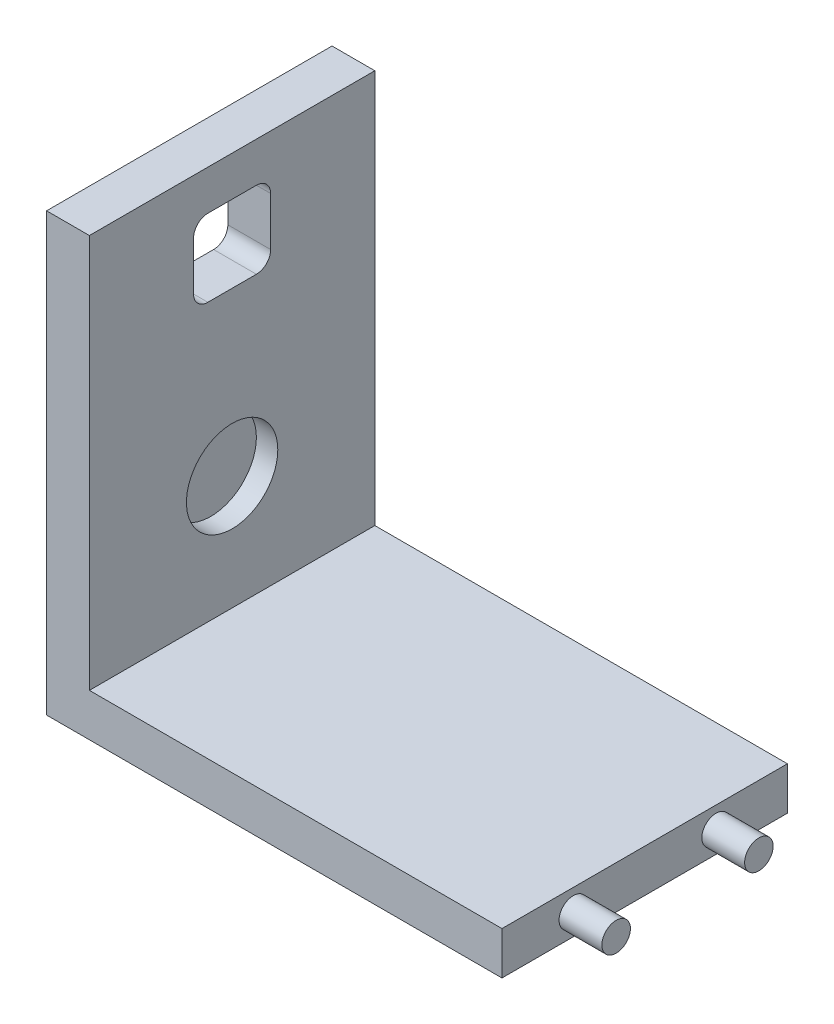
ISO-10303-21;
HEADER;
FILE_DESCRIPTION(('STEP AP214'),'2;1');
FILE_NAME('part.step','',(''),(''),'','','');
FILE_SCHEMA(('AUTOMOTIVE_DESIGN { 1 0 10303 214 1 1 1 1 }'));
ENDSEC;
DATA;
#1=APPLICATION_CONTEXT('core data for automotive mechanical design processes');
#2=APPLICATION_PROTOCOL_DEFINITION('international standard','automotive_design',2000,#1);
#3=PRODUCT_CONTEXT('',#1,'mechanical');
#4=PRODUCT('Part','Part','',(#3));
#5=PRODUCT_RELATED_PRODUCT_CATEGORY('part','',(#4));
#6=PRODUCT_DEFINITION_FORMATION('','',#4);
#7=PRODUCT_DEFINITION_CONTEXT('part definition',#1,'design');
#8=PRODUCT_DEFINITION('design','',#6,#7);
#9=PRODUCT_DEFINITION_SHAPE('','',#8);
#10=(LENGTH_UNIT() NAMED_UNIT(*) SI_UNIT(.MILLI.,.METRE.));
#11=(NAMED_UNIT(*) PLANE_ANGLE_UNIT() SI_UNIT($,.RADIAN.));
#12=(NAMED_UNIT(*) SI_UNIT($,.STERADIAN.) SOLID_ANGLE_UNIT());
#13=UNCERTAINTY_MEASURE_WITH_UNIT(LENGTH_MEASURE(1.E-05),#10,'distance_accuracy_value','');
#14=(GEOMETRIC_REPRESENTATION_CONTEXT(3) GLOBAL_UNCERTAINTY_ASSIGNED_CONTEXT((#13)) GLOBAL_UNIT_ASSIGNED_CONTEXT((#10,
#11,#12)) REPRESENTATION_CONTEXT('',''));
#15=CARTESIAN_POINT('',(0.,0.,0.));
#16=DIRECTION('',(0.,0.,1.));
#17=DIRECTION('',(1.,0.,0.));
#18=AXIS2_PLACEMENT_3D('',#15,#16,#17);
#19=CARTESIAN_POINT('',(-87.2699081698724,0.,-100.));
#20=DIRECTION('',(-1.,0.,0.));
#21=DIRECTION('',(0.,0.,1.));
#22=AXIS2_PLACEMENT_3D('',#19,#20,#21);
#23=PLANE('',#22);
#24=CARTESIAN_POINT('',(-87.2699081698724,117.,-58.5));
#25=DIRECTION('',(1.,0.,0.));
#26=DIRECTION('',(0.,0.,-1.));
#27=AXIS2_PLACEMENT_3D('',#24,#25,#26);
#28=CIRCLE('',#27,5.);
#29=CARTESIAN_POINT('',(-87.2699081698724,112.,-58.5));
#30=VERTEX_POINT('',#29);
#31=CARTESIAN_POINT('',(-87.2699081698724,117.,-63.5));
#32=VERTEX_POINT('',#31);
#33=EDGE_CURVE('E136',#30,#32,#28,.T.);
#34=ORIENTED_EDGE('',*,*,#33,.T.);
#35=DIRECTION('',(0.,1.,0.));
#36=VECTOR('',#35,1.);
#37=CARTESIAN_POINT('',(-87.2699081698724,134.,-63.5));
#38=LINE('',#37,#36);
#39=CARTESIAN_POINT('',(-87.2699081698724,134.,-63.5));
#40=VERTEX_POINT('',#39);
#41=EDGE_CURVE('E145',#32,#40,#38,.T.);
#42=ORIENTED_EDGE('',*,*,#41,.T.);
#43=CARTESIAN_POINT('',(-87.2699081698724,134.,-58.5));
#44=DIRECTION('',(1.,0.,0.));
#45=DIRECTION('',(0.,0.,1.));
#46=AXIS2_PLACEMENT_3D('',#43,#44,#45);
#47=CIRCLE('',#46,5.);
#48=CARTESIAN_POINT('',(-87.2699081698724,139.,-58.5));
#49=VERTEX_POINT('',#48);
#50=EDGE_CURVE('E49',#40,#49,#47,.T.);
#51=ORIENTED_EDGE('',*,*,#50,.T.);
#52=DIRECTION('',(0.,0.,1.));
#53=VECTOR('',#52,1.);
#54=CARTESIAN_POINT('',(-87.2699081698724,139.,-41.5));
#55=LINE('',#54,#53);
#56=CARTESIAN_POINT('',(-87.2699081698724,139.,-41.5));
#57=VERTEX_POINT('',#56);
#58=EDGE_CURVE('E159',#49,#57,#55,.T.);
#59=ORIENTED_EDGE('',*,*,#58,.T.);
#60=CARTESIAN_POINT('',(-87.2699081698724,134.,-41.5));
#61=DIRECTION('',(1.,0.,0.));
#62=DIRECTION('',(0.,0.,-1.));
#63=AXIS2_PLACEMENT_3D('',#60,#61,#62);
#64=CIRCLE('',#63,5.);
#65=CARTESIAN_POINT('',(-87.2699081698724,134.,-36.5));
#66=VERTEX_POINT('',#65);
#67=EDGE_CURVE('E162',#57,#66,#64,.T.);
#68=ORIENTED_EDGE('',*,*,#67,.T.);
#69=DIRECTION('',(0.,-1.,0.));
#70=VECTOR('',#69,1.);
#71=CARTESIAN_POINT('',(-87.2699081698724,134.,-36.5));
#72=LINE('',#71,#70);
#73=CARTESIAN_POINT('',(-87.2699081698724,117.,-36.5));
#74=VERTEX_POINT('',#73);
#75=EDGE_CURVE('E165',#66,#74,#72,.T.);
#76=ORIENTED_EDGE('',*,*,#75,.T.);
#77=CARTESIAN_POINT('',(-87.2699081698724,117.,-41.5));
#78=DIRECTION('',(1.,0.,0.));
#79=DIRECTION('',(0.,0.,-1.));
#80=AXIS2_PLACEMENT_3D('',#77,#78,#79);
#81=CIRCLE('',#80,5.);
#82=CARTESIAN_POINT('',(-87.2699081698724,112.,-41.5));
#83=VERTEX_POINT('',#82);
#84=EDGE_CURVE('E168',#74,#83,#81,.T.);
#85=ORIENTED_EDGE('',*,*,#84,.T.);
#86=DIRECTION('',(0.,0.,-1.));
#87=VECTOR('',#86,1.);
#88=CARTESIAN_POINT('',(-87.2699081698724,112.,-41.5));
#89=LINE('',#88,#87);
#90=EDGE_CURVE('E142',#83,#30,#89,.T.);
#91=ORIENTED_EDGE('',*,*,#90,.T.);
#92=EDGE_LOOP('',(#34,#42,#51,#59,#68,#76,#85,#91));
#93=FACE_BOUND('',#92,.T.);
#94=DIRECTION('',(0.,-1.,0.));
#95=VECTOR('',#94,1.);
#96=CARTESIAN_POINT('',(-87.2699081698724,0.,0.));
#97=LINE('',#96,#95);
#98=CARTESIAN_POINT('',(-87.2699081698724,153.,0.));
#99=VERTEX_POINT('',#98);
#100=CARTESIAN_POINT('',(-87.2699081698724,0.,0.));
#101=VERTEX_POINT('',#100);
#102=EDGE_CURVE('E217',#99,#101,#97,.T.);
#103=ORIENTED_EDGE('',*,*,#102,.F.);
#104=DIRECTION('',(0.,0.,1.));
#105=VECTOR('',#104,1.);
#106=CARTESIAN_POINT('',(-87.2699081698724,153.,-100.));
#107=LINE('',#106,#105);
#108=CARTESIAN_POINT('',(-87.2699081698724,153.,-100.));
#109=VERTEX_POINT('',#108);
#110=EDGE_CURVE('E11',#109,#99,#107,.T.);
#111=ORIENTED_EDGE('',*,*,#110,.F.);
#112=DIRECTION('',(0.,-1.,0.));
#113=VECTOR('',#112,1.);
#114=CARTESIAN_POINT('',(-87.2699081698724,0.,-100.));
#115=LINE('',#114,#113);
#116=CARTESIAN_POINT('',(-87.2699081698724,0.,-100.));
#117=VERTEX_POINT('',#116);
#118=EDGE_CURVE('E220',#109,#117,#115,.T.);
#119=ORIENTED_EDGE('',*,*,#118,.T.);
#120=DIRECTION('',(0.,0.,1.));
#121=VECTOR('',#120,1.);
#122=CARTESIAN_POINT('',(-87.2699081698724,0.,-100.));
#123=LINE('',#122,#121);
#124=EDGE_CURVE('E36',#117,#101,#123,.T.);
#125=ORIENTED_EDGE('',*,*,#124,.T.);
#126=EDGE_LOOP('',(#103,#111,#119,#125));
#127=FACE_BOUND('',#126,.T.);
#128=ADVANCED_FACE('F33',(#93,#127),#23,.T.);
#129=CARTESIAN_POINT('',(-87.2699081698724,153.,-100.));
#130=DIRECTION('',(0.,1.,0.));
#131=DIRECTION('',(0.,0.,1.));
#132=AXIS2_PLACEMENT_3D('',#129,#130,#131);
#133=PLANE('',#132);
#134=DIRECTION('',(-1.,0.,0.));
#135=VECTOR('',#134,1.);
#136=CARTESIAN_POINT('',(-87.2699081698724,153.,0.));
#137=LINE('',#136,#135);
#138=CARTESIAN_POINT('',(-72.2699081698724,153.,0.));
#139=VERTEX_POINT('',#138);
#140=EDGE_CURVE('E224',#139,#99,#137,.T.);
#141=ORIENTED_EDGE('',*,*,#140,.F.);
#142=DIRECTION('',(0.,0.,1.));
#143=VECTOR('',#142,1.);
#144=CARTESIAN_POINT('',(-72.2699081698724,153.,-100.));
#145=LINE('',#144,#143);
#146=CARTESIAN_POINT('',(-72.2699081698724,153.,-100.));
#147=VERTEX_POINT('',#146);
#148=EDGE_CURVE('E41',#147,#139,#145,.T.);
#149=ORIENTED_EDGE('',*,*,#148,.F.);
#150=DIRECTION('',(-1.,0.,0.));
#151=VECTOR('',#150,1.);
#152=CARTESIAN_POINT('',(-87.2699081698724,153.,-100.));
#153=LINE('',#152,#151);
#154=EDGE_CURVE('E236',#147,#109,#153,.T.);
#155=ORIENTED_EDGE('',*,*,#154,.T.);
#156=ORIENTED_EDGE('',*,*,#110,.T.);
#157=EDGE_LOOP('',(#141,#149,#155,#156));
#158=FACE_BOUND('',#157,.T.);
#159=ADVANCED_FACE('F272',(#158),#133,.T.);
#160=CARTESIAN_POINT('',(-72.2699081698724,153.,-100.));
#161=DIRECTION('',(1.,0.,0.));
#162=DIRECTION('',(0.,0.,-1.));
#163=AXIS2_PLACEMENT_3D('',#160,#161,#162);
#164=PLANE('',#163);
#165=CARTESIAN_POINT('',(-72.2699081698724,117.,-58.5));
#166=DIRECTION('',(1.,0.,0.));
#167=DIRECTION('',(0.,0.,-1.));
#168=AXIS2_PLACEMENT_3D('',#165,#166,#167);
#169=CIRCLE('',#168,5.);
#170=CARTESIAN_POINT('',(-72.2699081698724,112.,-58.5));
#171=VERTEX_POINT('',#170);
#172=CARTESIAN_POINT('',(-72.2699081698724,117.,-63.5));
#173=VERTEX_POINT('',#172);
#174=EDGE_CURVE('E57',#171,#173,#169,.T.);
#175=ORIENTED_EDGE('',*,*,#174,.F.);
#176=DIRECTION('',(0.,0.,-1.));
#177=VECTOR('',#176,1.);
#178=CARTESIAN_POINT('',(-72.2699081698724,112.,-41.5));
#179=LINE('',#178,#177);
#180=CARTESIAN_POINT('',(-72.2699081698724,112.,-41.5));
#181=VERTEX_POINT('',#180);
#182=EDGE_CURVE('E152',#181,#171,#179,.T.);
#183=ORIENTED_EDGE('',*,*,#182,.F.);
#184=CARTESIAN_POINT('',(-72.2699081698724,117.,-41.5));
#185=DIRECTION('',(1.,0.,0.));
#186=DIRECTION('',(0.,0.,-1.));
#187=AXIS2_PLACEMENT_3D('',#184,#185,#186);
#188=CIRCLE('',#187,5.);
#189=CARTESIAN_POINT('',(-72.2699081698724,117.,-36.5));
#190=VERTEX_POINT('',#189);
#191=EDGE_CURVE('E155',#190,#181,#188,.T.);
#192=ORIENTED_EDGE('',*,*,#191,.F.);
#193=DIRECTION('',(0.,-1.,0.));
#194=VECTOR('',#193,1.);
#195=CARTESIAN_POINT('',(-72.2699081698724,134.,-36.5));
#196=LINE('',#195,#194);
#197=CARTESIAN_POINT('',(-72.2699081698724,134.,-36.5));
#198=VERTEX_POINT('',#197);
#199=EDGE_CURVE('E183',#198,#190,#196,.T.);
#200=ORIENTED_EDGE('',*,*,#199,.F.);
#201=CARTESIAN_POINT('',(-72.2699081698724,134.,-41.5));
#202=DIRECTION('',(1.,0.,0.));
#203=DIRECTION('',(0.,0.,-1.));
#204=AXIS2_PLACEMENT_3D('',#201,#202,#203);
#205=CIRCLE('',#204,5.);
#206=CARTESIAN_POINT('',(-72.2699081698724,139.,-41.5));
#207=VERTEX_POINT('',#206);
#208=EDGE_CURVE('E180',#207,#198,#205,.T.);
#209=ORIENTED_EDGE('',*,*,#208,.F.);
#210=DIRECTION('',(0.,0.,1.));
#211=VECTOR('',#210,1.);
#212=CARTESIAN_POINT('',(-72.2699081698724,139.,-41.5));
#213=LINE('',#212,#211);
#214=CARTESIAN_POINT('',(-72.2699081698724,139.,-58.5));
#215=VERTEX_POINT('',#214);
#216=EDGE_CURVE('E177',#215,#207,#213,.T.);
#217=ORIENTED_EDGE('',*,*,#216,.F.);
#218=CARTESIAN_POINT('',(-72.2699081698724,134.,-58.5));
#219=DIRECTION('',(1.,0.,0.));
#220=DIRECTION('',(0.,0.,1.));
#221=AXIS2_PLACEMENT_3D('',#218,#219,#220);
#222=CIRCLE('',#221,5.);
#223=CARTESIAN_POINT('',(-72.2699081698724,134.,-63.5));
#224=VERTEX_POINT('',#223);
#225=EDGE_CURVE('E174',#224,#215,#222,.T.);
#226=ORIENTED_EDGE('',*,*,#225,.F.);
#227=DIRECTION('',(0.,1.,0.));
#228=VECTOR('',#227,1.);
#229=CARTESIAN_POINT('',(-72.2699081698724,134.,-63.5));
#230=LINE('',#229,#228);
#231=EDGE_CURVE('E172',#173,#224,#230,.T.);
#232=ORIENTED_EDGE('',*,*,#231,.F.);
#233=EDGE_LOOP('',(#175,#183,#192,#200,#209,#217,#226,#232));
#234=FACE_BOUND('',#233,.T.);
#235=CARTESIAN_POINT('',(-72.2699081698724,55.,-50.));
#236=DIRECTION('',(1.,0.,0.));
#237=DIRECTION('',(0.,0.,-1.));
#238=AXIS2_PLACEMENT_3D('',#235,#236,#237);
#239=CIRCLE('',#238,16.);
#240=CARTESIAN_POINT('',(-72.2699081698724,55.,-66.));
#241=VERTEX_POINT('',#240);
#242=EDGE_CURVE('E190',#241,#241,#239,.T.);
#243=ORIENTED_EDGE('',*,*,#242,.F.);
#244=EDGE_LOOP('',(#243));
#245=FACE_BOUND('',#244,.T.);
#246=DIRECTION('',(0.,1.,0.));
#247=VECTOR('',#246,1.);
#248=CARTESIAN_POINT('',(-72.2699081698724,153.,0.));
#249=LINE('',#248,#247);
#250=CARTESIAN_POINT('',(-72.2699081698724,15.,0.));
#251=VERTEX_POINT('',#250);
#252=EDGE_CURVE('E250',#251,#139,#249,.T.);
#253=ORIENTED_EDGE('',*,*,#252,.F.);
#254=DIRECTION('',(0.,0.,1.));
#255=VECTOR('',#254,1.);
#256=CARTESIAN_POINT('',(-72.2699081698724,15.,-100.));
#257=LINE('',#256,#255);
#258=CARTESIAN_POINT('',(-72.2699081698724,15.,-100.));
#259=VERTEX_POINT('',#258);
#260=EDGE_CURVE('E256',#259,#251,#257,.T.);
#261=ORIENTED_EDGE('',*,*,#260,.F.);
#262=DIRECTION('',(0.,1.,0.));
#263=VECTOR('',#262,1.);
#264=CARTESIAN_POINT('',(-72.2699081698724,153.,-100.));
#265=LINE('',#264,#263);
#266=EDGE_CURVE('E233',#259,#147,#265,.T.);
#267=ORIENTED_EDGE('',*,*,#266,.T.);
#268=ORIENTED_EDGE('',*,*,#148,.T.);
#269=EDGE_LOOP('',(#253,#261,#267,#268));
#270=FACE_BOUND('',#269,.T.);
#271=ADVANCED_FACE('F285',(#234,#245,#270),#164,.T.);
#272=CARTESIAN_POINT('',(72.2699081698724,15.,-100.));
#273=DIRECTION('',(0.,1.,0.));
#274=DIRECTION('',(-1.,0.,0.));
#275=AXIS2_PLACEMENT_3D('',#272,#273,#274);
#276=PLANE('',#275);
#277=DIRECTION('',(-1.,0.,0.));
#278=VECTOR('',#277,1.);
#279=CARTESIAN_POINT('',(72.2699081698724,15.,0.));
#280=LINE('',#279,#278);
#281=CARTESIAN_POINT('',(72.2699081698724,15.,0.));
#282=VERTEX_POINT('',#281);
#283=EDGE_CURVE('E247',#282,#251,#280,.T.);
#284=ORIENTED_EDGE('',*,*,#283,.F.);
#285=DIRECTION('',(0.,0.,1.));
#286=VECTOR('',#285,1.);
#287=CARTESIAN_POINT('',(72.2699081698724,15.,-100.));
#288=LINE('',#287,#286);
#289=CARTESIAN_POINT('',(72.2699081698724,15.,-100.));
#290=VERTEX_POINT('',#289);
#291=EDGE_CURVE('E258',#290,#282,#288,.T.);
#292=ORIENTED_EDGE('',*,*,#291,.F.);
#293=DIRECTION('',(-1.,0.,0.));
#294=VECTOR('',#293,1.);
#295=CARTESIAN_POINT('',(72.2699081698724,15.,-100.));
#296=LINE('',#295,#294);
#297=EDGE_CURVE('E230',#290,#259,#296,.T.);
#298=ORIENTED_EDGE('',*,*,#297,.T.);
#299=ORIENTED_EDGE('',*,*,#260,.T.);
#300=EDGE_LOOP('',(#284,#292,#298,#299));
#301=FACE_BOUND('',#300,.T.);
#302=ADVANCED_FACE('F283',(#301),#276,.T.);
#303=CARTESIAN_POINT('',(72.2699081698724,0.,-100.));
#304=DIRECTION('',(1.,0.,0.));
#305=DIRECTION('',(0.,0.,-1.));
#306=AXIS2_PLACEMENT_3D('',#303,#304,#305);
#307=PLANE('',#306);
#308=CARTESIAN_POINT('',(72.2699081698724,7.5,-75.));
#309=DIRECTION('',(1.,0.,0.));
#310=DIRECTION('',(0.,0.,-1.));
#311=AXIS2_PLACEMENT_3D('',#308,#309,#310);
#312=CIRCLE('',#311,5.);
#313=CARTESIAN_POINT('',(72.2699081698724,7.5,-80.));
#314=VERTEX_POINT('',#313);
#315=EDGE_CURVE('E205',#314,#314,#312,.T.);
#316=ORIENTED_EDGE('',*,*,#315,.F.);
#317=EDGE_LOOP('',(#316));
#318=FACE_BOUND('',#317,.T.);
#319=CARTESIAN_POINT('',(72.2699081698724,7.5,-25.));
#320=DIRECTION('',(1.,0.,0.));
#321=DIRECTION('',(0.,0.,-1.));
#322=AXIS2_PLACEMENT_3D('',#319,#320,#321);
#323=CIRCLE('',#322,5.);
#324=CARTESIAN_POINT('',(72.2699081698724,7.5,-30.));
#325=VERTEX_POINT('',#324);
#326=EDGE_CURVE('E211',#325,#325,#323,.T.);
#327=ORIENTED_EDGE('',*,*,#326,.F.);
#328=EDGE_LOOP('',(#327));
#329=FACE_BOUND('',#328,.T.);
#330=DIRECTION('',(0.,1.,0.));
#331=VECTOR('',#330,1.);
#332=CARTESIAN_POINT('',(72.2699081698724,0.,0.));
#333=LINE('',#332,#331);
#334=CARTESIAN_POINT('',(72.2699081698724,0.,0.));
#335=VERTEX_POINT('',#334);
#336=EDGE_CURVE('E244',#335,#282,#333,.T.);
#337=ORIENTED_EDGE('',*,*,#336,.F.);
#338=DIRECTION('',(0.,0.,1.));
#339=VECTOR('',#338,1.);
#340=CARTESIAN_POINT('',(72.2699081698724,0.,-100.));
#341=LINE('',#340,#339);
#342=CARTESIAN_POINT('',(72.2699081698724,0.,-100.));
#343=VERTEX_POINT('',#342);
#344=EDGE_CURVE('E259',#343,#335,#341,.T.);
#345=ORIENTED_EDGE('',*,*,#344,.F.);
#346=DIRECTION('',(0.,1.,0.));
#347=VECTOR('',#346,1.);
#348=CARTESIAN_POINT('',(72.2699081698724,0.,-100.));
#349=LINE('',#348,#347);
#350=EDGE_CURVE('E227',#343,#290,#349,.T.);
#351=ORIENTED_EDGE('',*,*,#350,.T.);
#352=ORIENTED_EDGE('',*,*,#291,.T.);
#353=EDGE_LOOP('',(#337,#345,#351,#352));
#354=FACE_BOUND('',#353,.T.);
#355=ADVANCED_FACE('F280',(#318,#329,#354),#307,.T.);
#356=CARTESIAN_POINT('',(-87.2699081698724,0.,-100.));
#357=DIRECTION('',(0.,-1.,0.));
#358=DIRECTION('',(1.,0.,0.));
#359=AXIS2_PLACEMENT_3D('',#356,#357,#358);
#360=PLANE('',#359);
#361=DIRECTION('',(1.,0.,0.));
#362=VECTOR('',#361,1.);
#363=CARTESIAN_POINT('',(-87.2699081698724,0.,0.));
#364=LINE('',#363,#362);
#365=EDGE_CURVE('E241',#101,#335,#364,.T.);
#366=ORIENTED_EDGE('',*,*,#365,.F.);
#367=ORIENTED_EDGE('',*,*,#124,.F.);
#368=DIRECTION('',(1.,0.,0.));
#369=VECTOR('',#368,1.);
#370=CARTESIAN_POINT('',(-87.2699081698724,0.,-100.));
#371=LINE('',#370,#369);
#372=EDGE_CURVE('E223',#117,#343,#371,.T.);
#373=ORIENTED_EDGE('',*,*,#372,.T.);
#374=ORIENTED_EDGE('',*,*,#344,.T.);
#375=EDGE_LOOP('',(#366,#367,#373,#374));
#376=FACE_BOUND('',#375,.T.);
#377=ADVANCED_FACE('F266',(#376),#360,.T.);
#378=CARTESIAN_POINT('',(0.,0.,-100.));
#379=DIRECTION('',(0.,0.,-1.));
#380=DIRECTION('',(-1.,0.,0.));
#381=AXIS2_PLACEMENT_3D('',#378,#379,#380);
#382=PLANE('',#381);
#383=ORIENTED_EDGE('',*,*,#118,.F.);
#384=ORIENTED_EDGE('',*,*,#154,.F.);
#385=ORIENTED_EDGE('',*,*,#266,.F.);
#386=ORIENTED_EDGE('',*,*,#297,.F.);
#387=ORIENTED_EDGE('',*,*,#350,.F.);
#388=ORIENTED_EDGE('',*,*,#372,.F.);
#389=EDGE_LOOP('',(#383,#384,#385,#386,#387,#388));
#390=FACE_BOUND('',#389,.T.);
#391=ADVANCED_FACE('F275',(#390),#382,.T.);
#392=CARTESIAN_POINT('',(0.,0.,0.));
#393=DIRECTION('',(0.,0.,-1.));
#394=DIRECTION('',(-1.,0.,0.));
#395=AXIS2_PLACEMENT_3D('',#392,#393,#394);
#396=PLANE('',#395);
#397=ORIENTED_EDGE('',*,*,#102,.T.);
#398=ORIENTED_EDGE('',*,*,#365,.T.);
#399=ORIENTED_EDGE('',*,*,#336,.T.);
#400=ORIENTED_EDGE('',*,*,#283,.T.);
#401=ORIENTED_EDGE('',*,*,#252,.T.);
#402=ORIENTED_EDGE('',*,*,#140,.T.);
#403=EDGE_LOOP('',(#397,#398,#399,#400,#401,#402));
#404=FACE_BOUND('',#403,.T.);
#405=ADVANCED_FACE('F268',(#404),#396,.F.);
#406=CARTESIAN_POINT('',(87.2699081698724,7.5,-25.));
#407=DIRECTION('',(-1.,0.,0.));
#408=DIRECTION('',(0.,0.,1.));
#409=AXIS2_PLACEMENT_3D('',#406,#407,#408);
#410=CYLINDRICAL_SURFACE('',#409,5.);
#411=CARTESIAN_POINT('',(87.2699081698724,7.5,-25.));
#412=DIRECTION('',(1.,0.,0.));
#413=DIRECTION('',(0.,0.,-1.));
#414=AXIS2_PLACEMENT_3D('',#411,#412,#413);
#415=CIRCLE('',#414,5.);
#416=CARTESIAN_POINT('',(87.2699081698724,7.5,-30.));
#417=VERTEX_POINT('',#416);
#418=EDGE_CURVE('E214',#417,#417,#415,.T.);
#419=ORIENTED_EDGE('',*,*,#418,.F.);
#420=EDGE_LOOP('',(#419));
#421=FACE_BOUND('',#420,.T.);
#422=ORIENTED_EDGE('',*,*,#326,.T.);
#423=EDGE_LOOP('',(#422));
#424=FACE_BOUND('',#423,.T.);
#425=ADVANCED_FACE('F337',(#421,#424),#410,.T.);
#426=CARTESIAN_POINT('',(87.2699081698724,7.5,-25.));
#427=DIRECTION('',(1.,0.,0.));
#428=DIRECTION('',(0.,0.,-1.));
#429=AXIS2_PLACEMENT_3D('',#426,#427,#428);
#430=PLANE('',#429);
#431=ORIENTED_EDGE('',*,*,#418,.T.);
#432=EDGE_LOOP('',(#431));
#433=FACE_BOUND('',#432,.T.);
#434=ADVANCED_FACE('F353',(#433),#430,.T.);
#435=CARTESIAN_POINT('',(87.2699081698724,7.5,-75.));
#436=DIRECTION('',(-1.,0.,0.));
#437=DIRECTION('',(0.,0.,1.));
#438=AXIS2_PLACEMENT_3D('',#435,#436,#437);
#439=CYLINDRICAL_SURFACE('',#438,5.);
#440=CARTESIAN_POINT('',(87.2699081698724,7.5,-75.));
#441=DIRECTION('',(1.,0.,0.));
#442=DIRECTION('',(0.,0.,-1.));
#443=AXIS2_PLACEMENT_3D('',#440,#441,#442);
#444=CIRCLE('',#443,5.);
#445=CARTESIAN_POINT('',(87.2699081698724,7.5,-80.));
#446=VERTEX_POINT('',#445);
#447=EDGE_CURVE('E208',#446,#446,#444,.T.);
#448=ORIENTED_EDGE('',*,*,#447,.F.);
#449=EDGE_LOOP('',(#448));
#450=FACE_BOUND('',#449,.T.);
#451=ORIENTED_EDGE('',*,*,#315,.T.);
#452=EDGE_LOOP('',(#451));
#453=FACE_BOUND('',#452,.T.);
#454=ADVANCED_FACE('F363',(#450,#453),#439,.T.);
#455=CARTESIAN_POINT('',(87.2699081698724,7.5,-75.));
#456=DIRECTION('',(1.,0.,0.));
#457=DIRECTION('',(0.,0.,-1.));
#458=AXIS2_PLACEMENT_3D('',#455,#456,#457);
#459=PLANE('',#458);
#460=ORIENTED_EDGE('',*,*,#447,.T.);
#461=EDGE_LOOP('',(#460));
#462=FACE_BOUND('',#461,.T.);
#463=ADVANCED_FACE('F373',(#462),#459,.T.);
#464=CARTESIAN_POINT('',(-79.7699081698724,55.,-50.));
#465=DIRECTION('',(1.,0.,0.));
#466=DIRECTION('',(0.,0.,-1.));
#467=AXIS2_PLACEMENT_3D('',#464,#465,#466);
#468=CYLINDRICAL_SURFACE('',#467,16.);
#469=CARTESIAN_POINT('',(-79.7699081698724,55.,-50.));
#470=DIRECTION('',(1.,0.,0.));
#471=DIRECTION('',(0.,0.,-1.));
#472=AXIS2_PLACEMENT_3D('',#469,#470,#471);
#473=CIRCLE('',#472,16.);
#474=CARTESIAN_POINT('',(-79.7699081698724,55.,-66.));
#475=VERTEX_POINT('',#474);
#476=EDGE_CURVE('E202',#475,#475,#473,.T.);
#477=ORIENTED_EDGE('',*,*,#476,.F.);
#478=EDGE_LOOP('',(#477));
#479=FACE_BOUND('',#478,.T.);
#480=ORIENTED_EDGE('',*,*,#242,.T.);
#481=EDGE_LOOP('',(#480));
#482=FACE_BOUND('',#481,.T.);
#483=ADVANCED_FACE('F383',(#479,#482),#468,.F.);
#484=CARTESIAN_POINT('',(-79.7699081698724,55.,-50.));
#485=DIRECTION('',(1.,0.,0.));
#486=DIRECTION('',(0.,0.,-1.));
#487=AXIS2_PLACEMENT_3D('',#484,#485,#486);
#488=PLANE('',#487);
#489=ORIENTED_EDGE('',*,*,#476,.T.);
#490=EDGE_LOOP('',(#489));
#491=FACE_BOUND('',#490,.T.);
#492=ADVANCED_FACE('F392',(#491),#488,.T.);
#493=CARTESIAN_POINT('',(-87.2699081698724,117.,-58.5));
#494=DIRECTION('',(1.,0.,0.));
#495=DIRECTION('',(0.,0.,-1.));
#496=AXIS2_PLACEMENT_3D('',#493,#494,#495);
#497=CYLINDRICAL_SURFACE('',#496,5.);
#498=ORIENTED_EDGE('',*,*,#174,.T.);
#499=DIRECTION('',(1.,0.,0.));
#500=VECTOR('',#499,1.);
#501=CARTESIAN_POINT('',(-87.2699081698724,117.,-63.5));
#502=LINE('',#501,#500);
#503=EDGE_CURVE('E132',#32,#173,#502,.T.);
#504=ORIENTED_EDGE('',*,*,#503,.F.);
#505=ORIENTED_EDGE('',*,*,#33,.F.);
#506=DIRECTION('',(1.,0.,0.));
#507=VECTOR('',#506,1.);
#508=CARTESIAN_POINT('',(-87.2699081698724,112.,-58.5));
#509=LINE('',#508,#507);
#510=EDGE_CURVE('E188',#30,#171,#509,.T.);
#511=ORIENTED_EDGE('',*,*,#510,.T.);
#512=EDGE_LOOP('',(#498,#504,#505,#511));
#513=FACE_BOUND('',#512,.T.);
#514=ADVANCED_FACE('F134',(#513),#497,.F.);
#515=CARTESIAN_POINT('',(-87.2699081698724,112.,-41.5));
#516=DIRECTION('',(0.,-1.,0.));
#517=DIRECTION('',(0.,0.,-1.));
#518=AXIS2_PLACEMENT_3D('',#515,#516,#517);
#519=PLANE('',#518);
#520=ORIENTED_EDGE('',*,*,#182,.T.);
#521=ORIENTED_EDGE('',*,*,#510,.F.);
#522=ORIENTED_EDGE('',*,*,#90,.F.);
#523=DIRECTION('',(1.,0.,0.));
#524=VECTOR('',#523,1.);
#525=CARTESIAN_POINT('',(-87.2699081698724,112.,-41.5));
#526=LINE('',#525,#524);
#527=EDGE_CURVE('E191',#83,#181,#526,.T.);
#528=ORIENTED_EDGE('',*,*,#527,.T.);
#529=EDGE_LOOP('',(#520,#521,#522,#528));
#530=FACE_BOUND('',#529,.T.);
#531=ADVANCED_FACE('F411',(#530),#519,.F.);
#532=CARTESIAN_POINT('',(-87.2699081698724,117.,-41.5));
#533=DIRECTION('',(1.,0.,0.));
#534=DIRECTION('',(0.,0.,-1.));
#535=AXIS2_PLACEMENT_3D('',#532,#533,#534);
#536=CYLINDRICAL_SURFACE('',#535,5.);
#537=ORIENTED_EDGE('',*,*,#191,.T.);
#538=ORIENTED_EDGE('',*,*,#527,.F.);
#539=ORIENTED_EDGE('',*,*,#84,.F.);
#540=DIRECTION('',(1.,0.,0.));
#541=VECTOR('',#540,1.);
#542=CARTESIAN_POINT('',(-87.2699081698724,117.,-36.5));
#543=LINE('',#542,#541);
#544=EDGE_CURVE('E193',#74,#190,#543,.T.);
#545=ORIENTED_EDGE('',*,*,#544,.T.);
#546=EDGE_LOOP('',(#537,#538,#539,#545));
#547=FACE_BOUND('',#546,.T.);
#548=ADVANCED_FACE('F417',(#547),#536,.F.);
#549=CARTESIAN_POINT('',(-87.2699081698724,134.,-36.5));
#550=DIRECTION('',(0.,0.,1.));
#551=DIRECTION('',(1.,0.,0.));
#552=AXIS2_PLACEMENT_3D('',#549,#550,#551);
#553=PLANE('',#552);
#554=ORIENTED_EDGE('',*,*,#199,.T.);
#555=ORIENTED_EDGE('',*,*,#544,.F.);
#556=ORIENTED_EDGE('',*,*,#75,.F.);
#557=DIRECTION('',(1.,0.,0.));
#558=VECTOR('',#557,1.);
#559=CARTESIAN_POINT('',(-87.2699081698724,134.,-36.5));
#560=LINE('',#559,#558);
#561=EDGE_CURVE('E195',#66,#198,#560,.T.);
#562=ORIENTED_EDGE('',*,*,#561,.T.);
#563=EDGE_LOOP('',(#554,#555,#556,#562));
#564=FACE_BOUND('',#563,.T.);
#565=ADVANCED_FACE('F425',(#564),#553,.F.);
#566=CARTESIAN_POINT('',(-87.2699081698724,134.,-41.5));
#567=DIRECTION('',(1.,0.,0.));
#568=DIRECTION('',(0.,0.,-1.));
#569=AXIS2_PLACEMENT_3D('',#566,#567,#568);
#570=CYLINDRICAL_SURFACE('',#569,5.);
#571=ORIENTED_EDGE('',*,*,#208,.T.);
#572=ORIENTED_EDGE('',*,*,#561,.F.);
#573=ORIENTED_EDGE('',*,*,#67,.F.);
#574=DIRECTION('',(1.,0.,0.));
#575=VECTOR('',#574,1.);
#576=CARTESIAN_POINT('',(-87.2699081698724,139.,-41.5));
#577=LINE('',#576,#575);
#578=EDGE_CURVE('E197',#57,#207,#577,.T.);
#579=ORIENTED_EDGE('',*,*,#578,.T.);
#580=EDGE_LOOP('',(#571,#572,#573,#579));
#581=FACE_BOUND('',#580,.T.);
#582=ADVANCED_FACE('F433',(#581),#570,.F.);
#583=CARTESIAN_POINT('',(-87.2699081698724,139.,-41.5));
#584=DIRECTION('',(0.,1.,0.));
#585=DIRECTION('',(0.,0.,1.));
#586=AXIS2_PLACEMENT_3D('',#583,#584,#585);
#587=PLANE('',#586);
#588=ORIENTED_EDGE('',*,*,#216,.T.);
#589=ORIENTED_EDGE('',*,*,#578,.F.);
#590=ORIENTED_EDGE('',*,*,#58,.F.);
#591=DIRECTION('',(1.,0.,0.));
#592=VECTOR('',#591,1.);
#593=CARTESIAN_POINT('',(-87.2699081698724,139.,-58.5));
#594=LINE('',#593,#592);
#595=EDGE_CURVE('E199',#49,#215,#594,.T.);
#596=ORIENTED_EDGE('',*,*,#595,.T.);
#597=EDGE_LOOP('',(#588,#589,#590,#596));
#598=FACE_BOUND('',#597,.T.);
#599=ADVANCED_FACE('F441',(#598),#587,.F.);
#600=CARTESIAN_POINT('',(-87.2699081698724,134.,-58.5));
#601=DIRECTION('',(1.,0.,0.));
#602=DIRECTION('',(0.,0.,-1.));
#603=AXIS2_PLACEMENT_3D('',#600,#601,#602);
#604=CYLINDRICAL_SURFACE('',#603,5.);
#605=ORIENTED_EDGE('',*,*,#225,.T.);
#606=ORIENTED_EDGE('',*,*,#595,.F.);
#607=ORIENTED_EDGE('',*,*,#50,.F.);
#608=DIRECTION('',(1.,0.,0.));
#609=VECTOR('',#608,1.);
#610=CARTESIAN_POINT('',(-87.2699081698724,134.,-63.5));
#611=LINE('',#610,#609);
#612=EDGE_CURVE('E141',#40,#224,#611,.T.);
#613=ORIENTED_EDGE('',*,*,#612,.T.);
#614=EDGE_LOOP('',(#605,#606,#607,#613));
#615=FACE_BOUND('',#614,.T.);
#616=ADVANCED_FACE('F449',(#615),#604,.F.);
#617=CARTESIAN_POINT('',(-87.2699081698724,134.,-63.5));
#618=DIRECTION('',(0.,0.,-1.));
#619=DIRECTION('',(0.,1.,0.));
#620=AXIS2_PLACEMENT_3D('',#617,#618,#619);
#621=PLANE('',#620);
#622=ORIENTED_EDGE('',*,*,#231,.T.);
#623=ORIENTED_EDGE('',*,*,#612,.F.);
#624=ORIENTED_EDGE('',*,*,#41,.F.);
#625=ORIENTED_EDGE('',*,*,#503,.T.);
#626=EDGE_LOOP('',(#622,#623,#624,#625));
#627=FACE_BOUND('',#626,.T.);
#628=ADVANCED_FACE('F146',(#627),#621,.F.);
#629=CLOSED_SHELL('',(#128,#159,#271,#302,#355,#377,#391,#405,#425,#434,#454,#463,#483,#492,
#514,#531,#548,#565,#582,#599,#616,#628));
#630=MANIFOLD_SOLID_BREP('B2',#629);
#631=ADVANCED_BREP_SHAPE_REPRESENTATION('',(#18,#630),#14);
#632=SHAPE_DEFINITION_REPRESENTATION(#9,#631);
ENDSEC;
END-ISO-10303-21;
